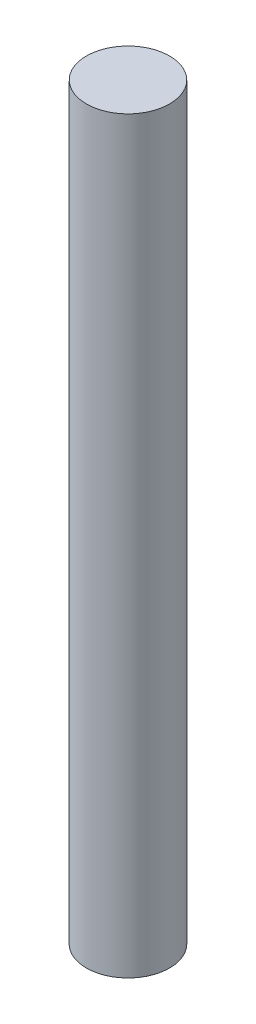
ISO-10303-21;
HEADER;
FILE_DESCRIPTION(('STEP AP214'),'2;1');
FILE_NAME('part.step','',(''),(''),'','','');
FILE_SCHEMA(('AUTOMOTIVE_DESIGN { 1 0 10303 214 1 1 1 1 }'));
ENDSEC;
DATA;
#1=APPLICATION_CONTEXT('core data for automotive mechanical design processes');
#2=APPLICATION_PROTOCOL_DEFINITION('international standard','automotive_design',2000,#1);
#3=PRODUCT_CONTEXT('',#1,'mechanical');
#4=PRODUCT('Part','Part','',(#3));
#5=PRODUCT_RELATED_PRODUCT_CATEGORY('part','',(#4));
#6=PRODUCT_DEFINITION_FORMATION('','',#4);
#7=PRODUCT_DEFINITION_CONTEXT('part definition',#1,'design');
#8=PRODUCT_DEFINITION('design','',#6,#7);
#9=PRODUCT_DEFINITION_SHAPE('','',#8);
#10=(LENGTH_UNIT() NAMED_UNIT(*) SI_UNIT(.MILLI.,.METRE.));
#11=(NAMED_UNIT(*) PLANE_ANGLE_UNIT() SI_UNIT($,.RADIAN.));
#12=(NAMED_UNIT(*) SI_UNIT($,.STERADIAN.) SOLID_ANGLE_UNIT());
#13=UNCERTAINTY_MEASURE_WITH_UNIT(LENGTH_MEASURE(1.E-05),#10,'distance_accuracy_value','');
#14=(GEOMETRIC_REPRESENTATION_CONTEXT(3) GLOBAL_UNCERTAINTY_ASSIGNED_CONTEXT((#13)) GLOBAL_UNIT_ASSIGNED_CONTEXT((#10,
#11,#12)) REPRESENTATION_CONTEXT('',''));
#15=CARTESIAN_POINT('',(0.,0.,0.));
#16=DIRECTION('',(0.,0.,1.));
#17=DIRECTION('',(1.,0.,0.));
#18=AXIS2_PLACEMENT_3D('',#15,#16,#17);
#19=CARTESIAN_POINT('',(0.,28.575,0.));
#20=DIRECTION('',(0.,-1.,0.));
#21=DIRECTION('',(0.,0.,-1.));
#22=AXIS2_PLACEMENT_3D('',#19,#20,#21);
#23=CYLINDRICAL_SURFACE('',#22,1.5875);
#24=CARTESIAN_POINT('',(0.,28.575,0.));
#25=DIRECTION('',(0.,1.,0.));
#26=DIRECTION('',(0.,0.,1.));
#27=AXIS2_PLACEMENT_3D('',#24,#25,#26);
#28=CIRCLE('',#27,1.5875);
#29=CARTESIAN_POINT('',(0.,28.575,1.5875));
#30=VERTEX_POINT('',#29);
#31=EDGE_CURVE('E10',#30,#30,#28,.T.);
#32=ORIENTED_EDGE('',*,*,#31,.F.);
#33=EDGE_LOOP('',(#32));
#34=FACE_BOUND('',#33,.T.);
#35=CARTESIAN_POINT('',(0.,0.,0.));
#36=DIRECTION('',(0.,1.,0.));
#37=DIRECTION('',(0.,0.,1.));
#38=AXIS2_PLACEMENT_3D('',#35,#36,#37);
#39=CIRCLE('',#38,1.5875);
#40=CARTESIAN_POINT('',(0.,0.,1.5875));
#41=VERTEX_POINT('',#40);
#42=EDGE_CURVE('E40',#41,#41,#39,.T.);
#43=ORIENTED_EDGE('',*,*,#42,.T.);
#44=EDGE_LOOP('',(#43));
#45=FACE_BOUND('',#44,.T.);
#46=ADVANCED_FACE('F37',(#34,#45),#23,.T.);
#47=CARTESIAN_POINT('',(0.,28.575,0.));
#48=DIRECTION('',(0.,1.,0.));
#49=DIRECTION('',(0.,0.,1.));
#50=AXIS2_PLACEMENT_3D('',#47,#48,#49);
#51=PLANE('',#50);
#52=ORIENTED_EDGE('',*,*,#31,.T.);
#53=EDGE_LOOP('',(#52));
#54=FACE_BOUND('',#53,.T.);
#55=ADVANCED_FACE('F54',(#54),#51,.T.);
#56=CARTESIAN_POINT('',(0.,0.,0.));
#57=DIRECTION('',(0.,1.,0.));
#58=DIRECTION('',(0.,0.,1.));
#59=AXIS2_PLACEMENT_3D('',#56,#57,#58);
#60=PLANE('',#59);
#61=ORIENTED_EDGE('',*,*,#42,.F.);
#62=EDGE_LOOP('',(#61));
#63=FACE_BOUND('',#62,.T.);
#64=ADVANCED_FACE('F52',(#63),#60,.F.);
#65=CLOSED_SHELL('',(#46,#55,#64));
#66=MANIFOLD_SOLID_BREP('B2',#65);
#67=ADVANCED_BREP_SHAPE_REPRESENTATION('',(#18,#66),#14);
#68=SHAPE_DEFINITION_REPRESENTATION(#9,#67);
ENDSEC;
END-ISO-10303-21;
